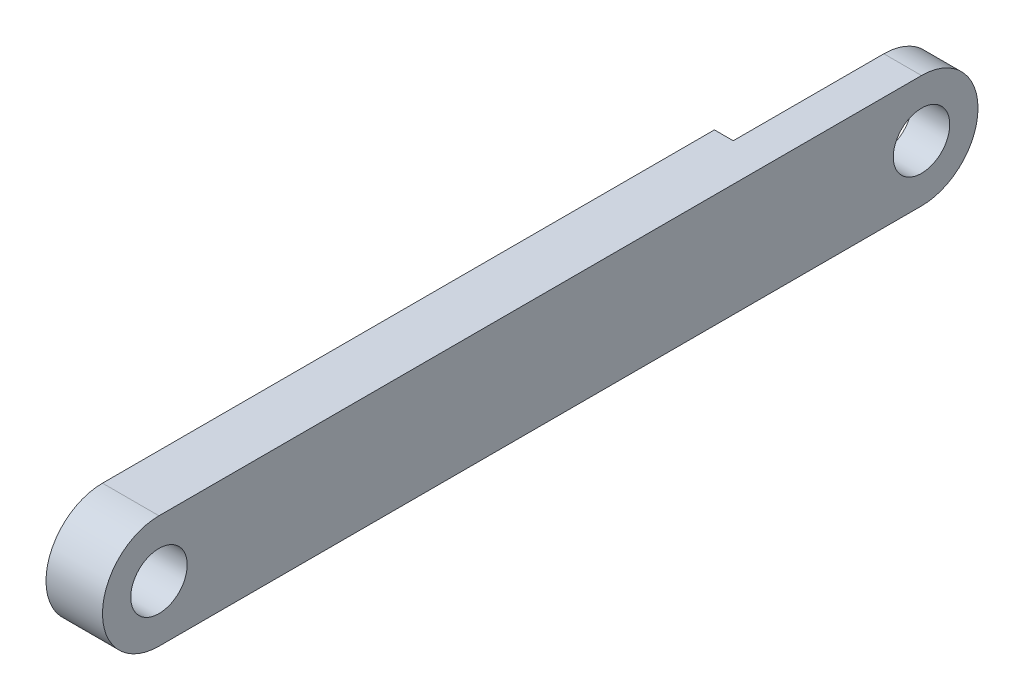
ISO-10303-21;
HEADER;
FILE_DESCRIPTION(('STEP AP214'),'2;1');
FILE_NAME('part.step','',(''),(''),'','','');
FILE_SCHEMA(('AUTOMOTIVE_DESIGN { 1 0 10303 214 1 1 1 1 }'));
ENDSEC;
DATA;
#1=APPLICATION_CONTEXT('core data for automotive mechanical design processes');
#2=APPLICATION_PROTOCOL_DEFINITION('international standard','automotive_design',2000,#1);
#3=PRODUCT_CONTEXT('',#1,'mechanical');
#4=PRODUCT('Part','Part','',(#3));
#5=PRODUCT_RELATED_PRODUCT_CATEGORY('part','',(#4));
#6=PRODUCT_DEFINITION_FORMATION('','',#4);
#7=PRODUCT_DEFINITION_CONTEXT('part definition',#1,'design');
#8=PRODUCT_DEFINITION('design','',#6,#7);
#9=PRODUCT_DEFINITION_SHAPE('','',#8);
#10=(LENGTH_UNIT() NAMED_UNIT(*) SI_UNIT(.MILLI.,.METRE.));
#11=(NAMED_UNIT(*) PLANE_ANGLE_UNIT() SI_UNIT($,.RADIAN.));
#12=(NAMED_UNIT(*) SI_UNIT($,.STERADIAN.) SOLID_ANGLE_UNIT());
#13=UNCERTAINTY_MEASURE_WITH_UNIT(LENGTH_MEASURE(1.E-05),#10,'distance_accuracy_value','');
#14=(GEOMETRIC_REPRESENTATION_CONTEXT(3) GLOBAL_UNCERTAINTY_ASSIGNED_CONTEXT((#13)) GLOBAL_UNIT_ASSIGNED_CONTEXT((#10,
#11,#12)) REPRESENTATION_CONTEXT('',''));
#15=CARTESIAN_POINT('',(0.,0.,0.));
#16=DIRECTION('',(0.,0.,1.));
#17=DIRECTION('',(1.,0.,0.));
#18=AXIS2_PLACEMENT_3D('',#15,#16,#17);
#19=CARTESIAN_POINT('',(3.,0.,0.));
#20=DIRECTION('',(1.,0.,0.));
#21=DIRECTION('',(0.,0.,-1.));
#22=AXIS2_PLACEMENT_3D('',#19,#20,#21);
#23=PLANE('',#22);
#24=CARTESIAN_POINT('',(3.,0.,-40.5));
#25=DIRECTION('',(1.,0.,0.));
#26=DIRECTION('',(0.,0.,-1.));
#27=AXIS2_PLACEMENT_3D('',#24,#25,#26);
#28=CIRCLE('',#27,1.5);
#29=CARTESIAN_POINT('',(3.,0.,-42.));
#30=VERTEX_POINT('',#29);
#31=EDGE_CURVE('E145',#30,#30,#28,.T.);
#32=ORIENTED_EDGE('',*,*,#31,.F.);
#33=EDGE_LOOP('',(#32));
#34=FACE_BOUND('',#33,.T.);
#35=CARTESIAN_POINT('',(3.,0.,0.));
#36=DIRECTION('',(1.,0.,0.));
#37=DIRECTION('',(0.,0.,-1.));
#38=AXIS2_PLACEMENT_3D('',#35,#36,#37);
#39=CIRCLE('',#38,3.);
#40=CARTESIAN_POINT('',(3.,3.,0.));
#41=VERTEX_POINT('',#40);
#42=CARTESIAN_POINT('',(3.,-3.,0.));
#43=VERTEX_POINT('',#42);
#44=EDGE_CURVE('E153',#41,#43,#39,.T.);
#45=ORIENTED_EDGE('',*,*,#44,.T.);
#46=DIRECTION('',(0.,0.,-1.));
#47=VECTOR('',#46,1.);
#48=CARTESIAN_POINT('',(3.,-3.,0.));
#49=LINE('',#48,#47);
#50=CARTESIAN_POINT('',(3.,-3.,-40.5));
#51=VERTEX_POINT('',#50);
#52=EDGE_CURVE('E95',#43,#51,#49,.T.);
#53=ORIENTED_EDGE('',*,*,#52,.T.);
#54=CARTESIAN_POINT('',(3.,0.,-40.5));
#55=DIRECTION('',(1.,0.,0.));
#56=DIRECTION('',(0.,0.,1.));
#57=AXIS2_PLACEMENT_3D('',#54,#55,#56);
#58=CIRCLE('',#57,3.);
#59=CARTESIAN_POINT('',(3.,3.,-40.5));
#60=VERTEX_POINT('',#59);
#61=EDGE_CURVE('E158',#51,#60,#58,.T.);
#62=ORIENTED_EDGE('',*,*,#61,.T.);
#63=DIRECTION('',(0.,0.,1.));
#64=VECTOR('',#63,1.);
#65=CARTESIAN_POINT('',(3.,3.,0.));
#66=LINE('',#65,#64);
#67=EDGE_CURVE('E73',#60,#41,#66,.T.);
#68=ORIENTED_EDGE('',*,*,#67,.T.);
#69=EDGE_LOOP('',(#45,#53,#62,#68));
#70=FACE_BOUND('',#69,.T.);
#71=CARTESIAN_POINT('',(3.,0.,0.));
#72=DIRECTION('',(1.,0.,0.));
#73=DIRECTION('',(0.,0.,-1.));
#74=AXIS2_PLACEMENT_3D('',#71,#72,#73);
#75=CIRCLE('',#74,1.5);
#76=CARTESIAN_POINT('',(3.,0.,-1.5));
#77=VERTEX_POINT('',#76);
#78=EDGE_CURVE('E141',#77,#77,#75,.T.);
#79=ORIENTED_EDGE('',*,*,#78,.F.);
#80=EDGE_LOOP('',(#79));
#81=FACE_BOUND('',#80,.T.);
#82=ADVANCED_FACE('F47',(#34,#70,#81),#23,.T.);
#83=CARTESIAN_POINT('',(0.,0.,0.));
#84=DIRECTION('',(1.,0.,0.));
#85=DIRECTION('',(0.,0.,-1.));
#86=AXIS2_PLACEMENT_3D('',#83,#84,#85);
#87=PLANE('',#86);
#88=DIRECTION('',(0.,0.,1.));
#89=VECTOR('',#88,1.);
#90=CARTESIAN_POINT('',(0.,3.,0.));
#91=LINE('',#90,#89);
#92=CARTESIAN_POINT('',(0.,3.,-32.5));
#93=VERTEX_POINT('',#92);
#94=CARTESIAN_POINT('',(0.,3.,0.));
#95=VERTEX_POINT('',#94);
#96=EDGE_CURVE('E88',#93,#95,#91,.T.);
#97=ORIENTED_EDGE('',*,*,#96,.F.);
#98=DIRECTION('',(0.,1.,0.));
#99=VECTOR('',#98,1.);
#100=CARTESIAN_POINT('',(0.,3.,-32.5));
#101=LINE('',#100,#99);
#102=CARTESIAN_POINT('',(0.,-3.,-32.5));
#103=VERTEX_POINT('',#102);
#104=EDGE_CURVE('E116',#103,#93,#101,.T.);
#105=ORIENTED_EDGE('',*,*,#104,.F.);
#106=DIRECTION('',(0.,0.,-1.));
#107=VECTOR('',#106,1.);
#108=CARTESIAN_POINT('',(0.,-3.,0.));
#109=LINE('',#108,#107);
#110=CARTESIAN_POINT('',(0.,-3.,0.));
#111=VERTEX_POINT('',#110);
#112=EDGE_CURVE('E129',#111,#103,#109,.T.);
#113=ORIENTED_EDGE('',*,*,#112,.F.);
#114=CARTESIAN_POINT('',(0.,0.,0.));
#115=DIRECTION('',(1.,0.,0.));
#116=DIRECTION('',(0.,0.,-1.));
#117=AXIS2_PLACEMENT_3D('',#114,#115,#116);
#118=CIRCLE('',#117,3.);
#119=EDGE_CURVE('E152',#95,#111,#118,.T.);
#120=ORIENTED_EDGE('',*,*,#119,.F.);
#121=EDGE_LOOP('',(#97,#105,#113,#120));
#122=FACE_BOUND('',#121,.T.);
#123=CARTESIAN_POINT('',(0.,0.,0.));
#124=DIRECTION('',(1.,0.,0.));
#125=DIRECTION('',(0.,0.,-1.));
#126=AXIS2_PLACEMENT_3D('',#123,#124,#125);
#127=CIRCLE('',#126,1.5);
#128=CARTESIAN_POINT('',(0.,0.,-1.5));
#129=VERTEX_POINT('',#128);
#130=EDGE_CURVE('E140',#129,#129,#127,.T.);
#131=ORIENTED_EDGE('',*,*,#130,.T.);
#132=EDGE_LOOP('',(#131));
#133=FACE_BOUND('',#132,.T.);
#134=ADVANCED_FACE('F188',(#122,#133),#87,.F.);
#135=CARTESIAN_POINT('',(3.,0.,0.));
#136=DIRECTION('',(-1.,0.,0.));
#137=DIRECTION('',(0.,0.,1.));
#138=AXIS2_PLACEMENT_3D('',#135,#136,#137);
#139=CYLINDRICAL_SURFACE('',#138,3.);
#140=ORIENTED_EDGE('',*,*,#119,.T.);
#141=DIRECTION('',(-1.,0.,0.));
#142=VECTOR('',#141,1.);
#143=CARTESIAN_POINT('',(3.,-3.,0.));
#144=LINE('',#143,#142);
#145=EDGE_CURVE('E11',#43,#111,#144,.T.);
#146=ORIENTED_EDGE('',*,*,#145,.F.);
#147=ORIENTED_EDGE('',*,*,#44,.F.);
#148=DIRECTION('',(-1.,0.,0.));
#149=VECTOR('',#148,1.);
#150=CARTESIAN_POINT('',(3.,3.,0.));
#151=LINE('',#150,#149);
#152=EDGE_CURVE('E163',#41,#95,#151,.T.);
#153=ORIENTED_EDGE('',*,*,#152,.T.);
#154=EDGE_LOOP('',(#140,#146,#147,#153));
#155=FACE_BOUND('',#154,.T.);
#156=ADVANCED_FACE('F49',(#155),#139,.T.);
#157=CARTESIAN_POINT('',(3.,-3.,0.));
#158=DIRECTION('',(0.,1.,0.));
#159=DIRECTION('',(0.,0.,1.));
#160=AXIS2_PLACEMENT_3D('',#157,#158,#159);
#161=PLANE('',#160);
#162=ORIENTED_EDGE('',*,*,#112,.T.);
#163=DIRECTION('',(-1.,0.,0.));
#164=VECTOR('',#163,1.);
#165=CARTESIAN_POINT('',(1.,-3.,-32.5));
#166=LINE('',#165,#164);
#167=CARTESIAN_POINT('',(1.,-3.,-32.5));
#168=VERTEX_POINT('',#167);
#169=EDGE_CURVE('E120',#168,#103,#166,.T.);
#170=ORIENTED_EDGE('',*,*,#169,.F.);
#171=DIRECTION('',(0.,0.,1.));
#172=VECTOR('',#171,1.);
#173=CARTESIAN_POINT('',(1.,-3.,-32.5));
#174=LINE('',#173,#172);
#175=CARTESIAN_POINT('',(1.,-3.,-40.5));
#176=VERTEX_POINT('',#175);
#177=EDGE_CURVE('E110',#176,#168,#174,.T.);
#178=ORIENTED_EDGE('',*,*,#177,.F.);
#179=DIRECTION('',(-1.,0.,0.));
#180=VECTOR('',#179,1.);
#181=CARTESIAN_POINT('',(3.,-3.,-40.5));
#182=LINE('',#181,#180);
#183=EDGE_CURVE('E57',#51,#176,#182,.T.);
#184=ORIENTED_EDGE('',*,*,#183,.F.);
#185=ORIENTED_EDGE('',*,*,#52,.F.);
#186=ORIENTED_EDGE('',*,*,#145,.T.);
#187=EDGE_LOOP('',(#162,#170,#178,#184,#185,#186));
#188=FACE_BOUND('',#187,.T.);
#189=ADVANCED_FACE('F128',(#188),#161,.F.);
#190=CARTESIAN_POINT('',(3.,0.,-40.5));
#191=DIRECTION('',(-1.,0.,0.));
#192=DIRECTION('',(0.,0.,1.));
#193=AXIS2_PLACEMENT_3D('',#190,#191,#192);
#194=CYLINDRICAL_SURFACE('',#193,3.);
#195=CARTESIAN_POINT('',(1.,0.,-40.5));
#196=DIRECTION('',(1.,0.,0.));
#197=DIRECTION('',(0.,0.,-1.));
#198=AXIS2_PLACEMENT_3D('',#195,#196,#197);
#199=CIRCLE('',#198,3.);
#200=CARTESIAN_POINT('',(1.,3.,-40.5));
#201=VERTEX_POINT('',#200);
#202=EDGE_CURVE('E112',#176,#201,#199,.T.);
#203=ORIENTED_EDGE('',*,*,#202,.T.);
#204=DIRECTION('',(-1.,0.,0.));
#205=VECTOR('',#204,1.);
#206=CARTESIAN_POINT('',(3.,3.,-40.5));
#207=LINE('',#206,#205);
#208=EDGE_CURVE('E173',#60,#201,#207,.T.);
#209=ORIENTED_EDGE('',*,*,#208,.F.);
#210=ORIENTED_EDGE('',*,*,#61,.F.);
#211=ORIENTED_EDGE('',*,*,#183,.T.);
#212=EDGE_LOOP('',(#203,#209,#210,#211));
#213=FACE_BOUND('',#212,.T.);
#214=ADVANCED_FACE('F180',(#213),#194,.T.);
#215=CARTESIAN_POINT('',(3.,3.,0.));
#216=DIRECTION('',(0.,-1.,0.));
#217=DIRECTION('',(0.,0.,-1.));
#218=AXIS2_PLACEMENT_3D('',#215,#216,#217);
#219=PLANE('',#218);
#220=DIRECTION('',(0.,0.,-1.));
#221=VECTOR('',#220,1.);
#222=CARTESIAN_POINT('',(1.,3.,-43.5));
#223=LINE('',#222,#221);
#224=CARTESIAN_POINT('',(1.,3.,-32.5));
#225=VERTEX_POINT('',#224);
#226=EDGE_CURVE('E125',#225,#201,#223,.T.);
#227=ORIENTED_EDGE('',*,*,#226,.F.);
#228=DIRECTION('',(-1.,0.,0.));
#229=VECTOR('',#228,1.);
#230=CARTESIAN_POINT('',(1.,3.,-32.5));
#231=LINE('',#230,#229);
#232=EDGE_CURVE('E122',#225,#93,#231,.T.);
#233=ORIENTED_EDGE('',*,*,#232,.T.);
#234=ORIENTED_EDGE('',*,*,#96,.T.);
#235=ORIENTED_EDGE('',*,*,#152,.F.);
#236=ORIENTED_EDGE('',*,*,#67,.F.);
#237=ORIENTED_EDGE('',*,*,#208,.T.);
#238=EDGE_LOOP('',(#227,#233,#234,#235,#236,#237));
#239=FACE_BOUND('',#238,.T.);
#240=ADVANCED_FACE('F191',(#239),#219,.F.);
#241=CARTESIAN_POINT('',(3.,0.,-40.5));
#242=DIRECTION('',(-1.,0.,0.));
#243=DIRECTION('',(0.,0.,1.));
#244=AXIS2_PLACEMENT_3D('',#241,#242,#243);
#245=CYLINDRICAL_SURFACE('',#244,1.5);
#246=CARTESIAN_POINT('',(1.,0.,-40.5));
#247=DIRECTION('',(1.,0.,0.));
#248=DIRECTION('',(0.,0.,-1.));
#249=AXIS2_PLACEMENT_3D('',#246,#247,#248);
#250=CIRCLE('',#249,1.5);
#251=CARTESIAN_POINT('',(1.,0.,-42.));
#252=VERTEX_POINT('',#251);
#253=EDGE_CURVE('E51',#252,#252,#250,.T.);
#254=ORIENTED_EDGE('',*,*,#253,.F.);
#255=EDGE_LOOP('',(#254));
#256=FACE_BOUND('',#255,.T.);
#257=ORIENTED_EDGE('',*,*,#31,.T.);
#258=EDGE_LOOP('',(#257));
#259=FACE_BOUND('',#258,.T.);
#260=ADVANCED_FACE('F193',(#256,#259),#245,.F.);
#261=CARTESIAN_POINT('',(3.,0.,0.));
#262=DIRECTION('',(-1.,0.,0.));
#263=DIRECTION('',(0.,0.,1.));
#264=AXIS2_PLACEMENT_3D('',#261,#262,#263);
#265=CYLINDRICAL_SURFACE('',#264,1.5);
#266=ORIENTED_EDGE('',*,*,#78,.T.);
#267=EDGE_LOOP('',(#266));
#268=FACE_BOUND('',#267,.T.);
#269=ORIENTED_EDGE('',*,*,#130,.F.);
#270=EDGE_LOOP('',(#269));
#271=FACE_BOUND('',#270,.T.);
#272=ADVANCED_FACE('F199',(#268,#271),#265,.F.);
#273=CARTESIAN_POINT('',(1.,0.,0.));
#274=DIRECTION('',(1.,0.,0.));
#275=DIRECTION('',(0.,0.,-1.));
#276=AXIS2_PLACEMENT_3D('',#273,#274,#275);
#277=PLANE('',#276);
#278=ORIENTED_EDGE('',*,*,#253,.T.);
#279=EDGE_LOOP('',(#278));
#280=FACE_BOUND('',#279,.T.);
#281=ORIENTED_EDGE('',*,*,#202,.F.);
#282=ORIENTED_EDGE('',*,*,#177,.T.);
#283=DIRECTION('',(0.,1.,0.));
#284=VECTOR('',#283,1.);
#285=CARTESIAN_POINT('',(1.,3.,-32.5));
#286=LINE('',#285,#284);
#287=EDGE_CURVE('E64',#168,#225,#286,.T.);
#288=ORIENTED_EDGE('',*,*,#287,.T.);
#289=ORIENTED_EDGE('',*,*,#226,.T.);
#290=EDGE_LOOP('',(#281,#282,#288,#289));
#291=FACE_BOUND('',#290,.T.);
#292=ADVANCED_FACE('F111',(#280,#291),#277,.F.);
#293=CARTESIAN_POINT('',(1.,3.,-32.5));
#294=DIRECTION('',(0.,0.,1.));
#295=DIRECTION('',(1.,0.,0.));
#296=AXIS2_PLACEMENT_3D('',#293,#294,#295);
#297=PLANE('',#296);
#298=ORIENTED_EDGE('',*,*,#104,.T.);
#299=ORIENTED_EDGE('',*,*,#232,.F.);
#300=ORIENTED_EDGE('',*,*,#287,.F.);
#301=ORIENTED_EDGE('',*,*,#169,.T.);
#302=EDGE_LOOP('',(#298,#299,#300,#301));
#303=FACE_BOUND('',#302,.T.);
#304=ADVANCED_FACE('F119',(#303),#297,.F.);
#305=CLOSED_SHELL('',(#82,#134,#156,#189,#214,#240,#260,#272,#292,#304));
#306=MANIFOLD_SOLID_BREP('B2',#305);
#307=ADVANCED_BREP_SHAPE_REPRESENTATION('',(#18,#306),#14);
#308=SHAPE_DEFINITION_REPRESENTATION(#9,#307);
ENDSEC;
END-ISO-10303-21;
